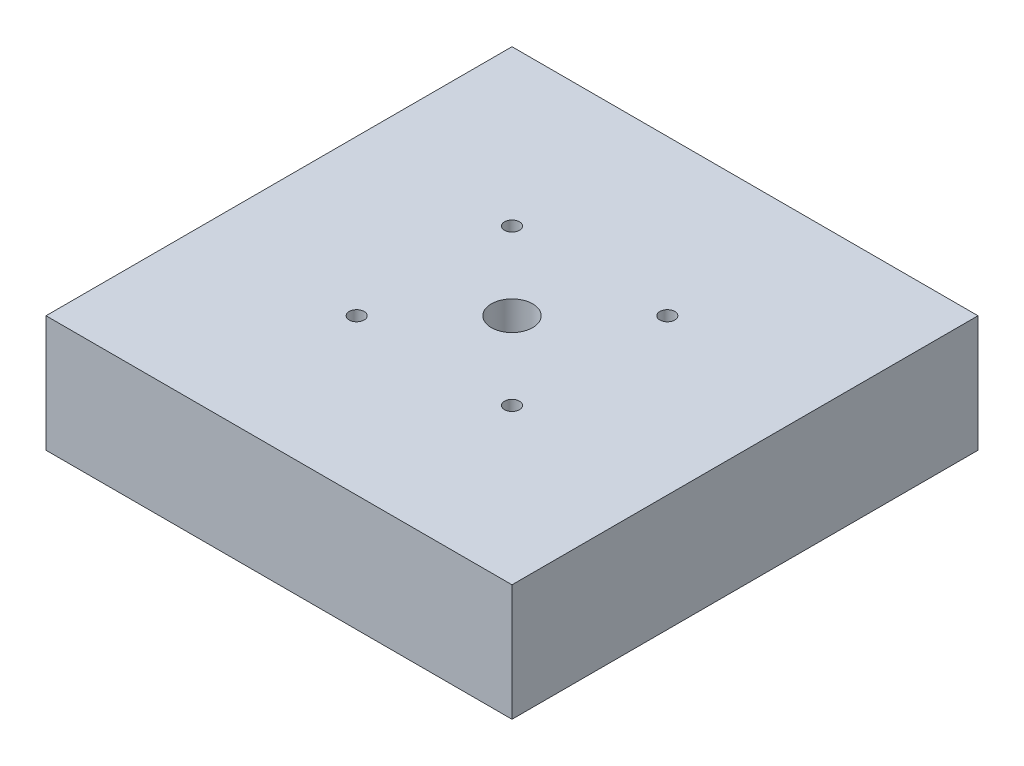
ISO-10303-21;
HEADER;
FILE_DESCRIPTION(('STEP AP214'),'2;1');
FILE_NAME('part.step','',(''),(''),'','','');
FILE_SCHEMA(('AUTOMOTIVE_DESIGN { 1 0 10303 214 1 1 1 1 }'));
ENDSEC;
DATA;
#1=APPLICATION_CONTEXT('core data for automotive mechanical design processes');
#2=APPLICATION_PROTOCOL_DEFINITION('international standard','automotive_design',2000,#1);
#3=PRODUCT_CONTEXT('',#1,'mechanical');
#4=PRODUCT('Part','Part','',(#3));
#5=PRODUCT_RELATED_PRODUCT_CATEGORY('part','',(#4));
#6=PRODUCT_DEFINITION_FORMATION('','',#4);
#7=PRODUCT_DEFINITION_CONTEXT('part definition',#1,'design');
#8=PRODUCT_DEFINITION('design','',#6,#7);
#9=PRODUCT_DEFINITION_SHAPE('','',#8);
#10=(LENGTH_UNIT() NAMED_UNIT(*) SI_UNIT(.MILLI.,.METRE.));
#11=(NAMED_UNIT(*) PLANE_ANGLE_UNIT() SI_UNIT($,.RADIAN.));
#12=(NAMED_UNIT(*) SI_UNIT($,.STERADIAN.) SOLID_ANGLE_UNIT());
#13=UNCERTAINTY_MEASURE_WITH_UNIT(LENGTH_MEASURE(1.E-05),#10,'distance_accuracy_value','');
#14=(GEOMETRIC_REPRESENTATION_CONTEXT(3) GLOBAL_UNCERTAINTY_ASSIGNED_CONTEXT((#13)) GLOBAL_UNIT_ASSIGNED_CONTEXT((#10,
#11,#12)) REPRESENTATION_CONTEXT('',''));
#15=CARTESIAN_POINT('',(0.,0.,0.));
#16=DIRECTION('',(0.,0.,1.));
#17=DIRECTION('',(1.,0.,0.));
#18=AXIS2_PLACEMENT_3D('',#15,#16,#17);
#19=CARTESIAN_POINT('',(-38.1,19.05,38.1));
#20=DIRECTION('',(1.,0.,0.));
#21=DIRECTION('',(0.,0.,-1.));
#22=AXIS2_PLACEMENT_3D('',#19,#20,#21);
#23=PLANE('',#22);
#24=DIRECTION('',(0.,0.,1.));
#25=VECTOR('',#24,1.);
#26=CARTESIAN_POINT('',(-38.1,0.,38.1));
#27=LINE('',#26,#25);
#28=CARTESIAN_POINT('',(-38.1,0.,-38.1));
#29=VERTEX_POINT('',#28);
#30=CARTESIAN_POINT('',(-38.1,0.,38.1));
#31=VERTEX_POINT('',#30);
#32=EDGE_CURVE('E96',#29,#31,#27,.T.);
#33=ORIENTED_EDGE('',*,*,#32,.T.);
#34=DIRECTION('',(0.,-1.,0.));
#35=VECTOR('',#34,1.);
#36=CARTESIAN_POINT('',(-38.1,19.05,38.1));
#37=LINE('',#36,#35);
#38=CARTESIAN_POINT('',(-38.1,19.05,38.1));
#39=VERTEX_POINT('',#38);
#40=EDGE_CURVE('E11',#39,#31,#37,.T.);
#41=ORIENTED_EDGE('',*,*,#40,.F.);
#42=DIRECTION('',(0.,0.,1.));
#43=VECTOR('',#42,1.);
#44=CARTESIAN_POINT('',(-38.1,19.05,38.1));
#45=LINE('',#44,#43);
#46=CARTESIAN_POINT('',(-38.1,19.05,-38.1));
#47=VERTEX_POINT('',#46);
#48=EDGE_CURVE('E84',#47,#39,#45,.T.);
#49=ORIENTED_EDGE('',*,*,#48,.F.);
#50=DIRECTION('',(0.,-1.,0.));
#51=VECTOR('',#50,1.);
#52=CARTESIAN_POINT('',(-38.1,19.05,-38.1));
#53=LINE('',#52,#51);
#54=EDGE_CURVE('E92',#47,#29,#53,.T.);
#55=ORIENTED_EDGE('',*,*,#54,.T.);
#56=EDGE_LOOP('',(#33,#41,#49,#55));
#57=FACE_BOUND('',#56,.T.);
#58=ADVANCED_FACE('F33',(#57),#23,.F.);
#59=CARTESIAN_POINT('',(38.1,19.05,38.1));
#60=DIRECTION('',(0.,0.,-1.));
#61=DIRECTION('',(-1.,0.,0.));
#62=AXIS2_PLACEMENT_3D('',#59,#60,#61);
#63=PLANE('',#62);
#64=DIRECTION('',(1.,0.,0.));
#65=VECTOR('',#64,1.);
#66=CARTESIAN_POINT('',(38.1,0.,38.1));
#67=LINE('',#66,#65);
#68=CARTESIAN_POINT('',(38.1,0.,38.1));
#69=VERTEX_POINT('',#68);
#70=EDGE_CURVE('E88',#31,#69,#67,.T.);
#71=ORIENTED_EDGE('',*,*,#70,.T.);
#72=DIRECTION('',(0.,-1.,0.));
#73=VECTOR('',#72,1.);
#74=CARTESIAN_POINT('',(38.1,19.05,38.1));
#75=LINE('',#74,#73);
#76=CARTESIAN_POINT('',(38.1,19.05,38.1));
#77=VERTEX_POINT('',#76);
#78=EDGE_CURVE('E41',#77,#69,#75,.T.);
#79=ORIENTED_EDGE('',*,*,#78,.F.);
#80=DIRECTION('',(1.,0.,0.));
#81=VECTOR('',#80,1.);
#82=CARTESIAN_POINT('',(38.1,19.05,38.1));
#83=LINE('',#82,#81);
#84=EDGE_CURVE('E79',#39,#77,#83,.T.);
#85=ORIENTED_EDGE('',*,*,#84,.F.);
#86=ORIENTED_EDGE('',*,*,#40,.T.);
#87=EDGE_LOOP('',(#71,#79,#85,#86));
#88=FACE_BOUND('',#87,.T.);
#89=ADVANCED_FACE('F87',(#88),#63,.F.);
#90=CARTESIAN_POINT('',(38.1,19.05,38.1));
#91=DIRECTION('',(-1.,0.,0.));
#92=DIRECTION('',(0.,0.,1.));
#93=AXIS2_PLACEMENT_3D('',#90,#91,#92);
#94=PLANE('',#93);
#95=DIRECTION('',(0.,0.,-1.));
#96=VECTOR('',#95,1.);
#97=CARTESIAN_POINT('',(38.1,0.,38.1));
#98=LINE('',#97,#96);
#99=CARTESIAN_POINT('',(38.1,0.,-38.1));
#100=VERTEX_POINT('',#99);
#101=EDGE_CURVE('E66',#69,#100,#98,.T.);
#102=ORIENTED_EDGE('',*,*,#101,.T.);
#103=DIRECTION('',(0.,-1.,0.));
#104=VECTOR('',#103,1.);
#105=CARTESIAN_POINT('',(38.1,19.05,-38.1));
#106=LINE('',#105,#104);
#107=CARTESIAN_POINT('',(38.1,19.05,-38.1));
#108=VERTEX_POINT('',#107);
#109=EDGE_CURVE('E89',#108,#100,#106,.T.);
#110=ORIENTED_EDGE('',*,*,#109,.F.);
#111=DIRECTION('',(0.,0.,-1.));
#112=VECTOR('',#111,1.);
#113=CARTESIAN_POINT('',(38.1,19.05,38.1));
#114=LINE('',#113,#112);
#115=EDGE_CURVE('E82',#77,#108,#114,.T.);
#116=ORIENTED_EDGE('',*,*,#115,.F.);
#117=ORIENTED_EDGE('',*,*,#78,.T.);
#118=EDGE_LOOP('',(#102,#110,#116,#117));
#119=FACE_BOUND('',#118,.T.);
#120=ADVANCED_FACE('F90',(#119),#94,.F.);
#121=CARTESIAN_POINT('',(38.1,19.05,-38.1));
#122=DIRECTION('',(0.,0.,1.));
#123=DIRECTION('',(1.,0.,0.));
#124=AXIS2_PLACEMENT_3D('',#121,#122,#123);
#125=PLANE('',#124);
#126=DIRECTION('',(-1.,0.,0.));
#127=VECTOR('',#126,1.);
#128=CARTESIAN_POINT('',(38.1,0.,-38.1));
#129=LINE('',#128,#127);
#130=EDGE_CURVE('E72',#100,#29,#129,.T.);
#131=ORIENTED_EDGE('',*,*,#130,.T.);
#132=ORIENTED_EDGE('',*,*,#54,.F.);
#133=DIRECTION('',(-1.,0.,0.));
#134=VECTOR('',#133,1.);
#135=CARTESIAN_POINT('',(38.1,19.05,-38.1));
#136=LINE('',#135,#134);
#137=EDGE_CURVE('E49',#108,#47,#136,.T.);
#138=ORIENTED_EDGE('',*,*,#137,.F.);
#139=ORIENTED_EDGE('',*,*,#109,.T.);
#140=EDGE_LOOP('',(#131,#132,#138,#139));
#141=FACE_BOUND('',#140,.T.);
#142=ADVANCED_FACE('F104',(#141),#125,.F.);
#143=CARTESIAN_POINT('',(0.,19.05,0.));
#144=DIRECTION('',(0.,1.,0.));
#145=DIRECTION('',(0.,0.,1.));
#146=AXIS2_PLACEMENT_3D('',#143,#144,#145);
#147=PLANE('',#146);
#148=CARTESIAN_POINT('',(12.7,19.05,-12.7));
#149=DIRECTION('',(0.,1.,0.));
#150=DIRECTION('',(0.,0.,1.));
#151=AXIS2_PLACEMENT_3D('',#148,#149,#150);
#152=CIRCLE('',#151,1.21919999999999);
#153=CARTESIAN_POINT('',(12.7,19.05,-11.4808));
#154=VERTEX_POINT('',#153);
#155=EDGE_CURVE('E136',#154,#154,#152,.T.);
#156=ORIENTED_EDGE('',*,*,#155,.F.);
#157=EDGE_LOOP('',(#156));
#158=FACE_BOUND('',#157,.T.);
#159=CARTESIAN_POINT('',(-12.7,19.05,12.7));
#160=DIRECTION('',(0.,1.,0.));
#161=DIRECTION('',(0.,0.,1.));
#162=AXIS2_PLACEMENT_3D('',#159,#160,#161);
#163=CIRCLE('',#162,1.21919999999999);
#164=CARTESIAN_POINT('',(-12.7,19.05,13.9192));
#165=VERTEX_POINT('',#164);
#166=EDGE_CURVE('E130',#165,#165,#163,.T.);
#167=ORIENTED_EDGE('',*,*,#166,.F.);
#168=EDGE_LOOP('',(#167));
#169=FACE_BOUND('',#168,.T.);
#170=CARTESIAN_POINT('',(12.7,19.05,12.7));
#171=DIRECTION('',(0.,1.,0.));
#172=DIRECTION('',(0.,0.,1.));
#173=AXIS2_PLACEMENT_3D('',#170,#171,#172);
#174=CIRCLE('',#173,1.21919999999999);
#175=CARTESIAN_POINT('',(12.7,19.05,13.9192));
#176=VERTEX_POINT('',#175);
#177=EDGE_CURVE('E124',#176,#176,#174,.T.);
#178=ORIENTED_EDGE('',*,*,#177,.F.);
#179=EDGE_LOOP('',(#178));
#180=FACE_BOUND('',#179,.T.);
#181=CARTESIAN_POINT('',(-12.7,19.05,-12.7));
#182=DIRECTION('',(0.,1.,0.));
#183=DIRECTION('',(0.,0.,1.));
#184=AXIS2_PLACEMENT_3D('',#181,#182,#183);
#185=CIRCLE('',#184,1.21919999999999);
#186=CARTESIAN_POINT('',(-12.7,19.05,-11.4808));
#187=VERTEX_POINT('',#186);
#188=EDGE_CURVE('E118',#187,#187,#185,.T.);
#189=ORIENTED_EDGE('',*,*,#188,.F.);
#190=EDGE_LOOP('',(#189));
#191=FACE_BOUND('',#190,.T.);
#192=CARTESIAN_POINT('',(0.,19.05,0.));
#193=DIRECTION('',(0.,1.,0.));
#194=DIRECTION('',(0.,0.,1.));
#195=AXIS2_PLACEMENT_3D('',#192,#193,#194);
#196=CIRCLE('',#195,3.37819999999999);
#197=CARTESIAN_POINT('',(0.,19.05,3.37819999999999));
#198=VERTEX_POINT('',#197);
#199=EDGE_CURVE('E112',#198,#198,#196,.T.);
#200=ORIENTED_EDGE('',*,*,#199,.F.);
#201=EDGE_LOOP('',(#200));
#202=FACE_BOUND('',#201,.T.);
#203=ORIENTED_EDGE('',*,*,#48,.T.);
#204=ORIENTED_EDGE('',*,*,#84,.T.);
#205=ORIENTED_EDGE('',*,*,#115,.T.);
#206=ORIENTED_EDGE('',*,*,#137,.T.);
#207=EDGE_LOOP('',(#203,#204,#205,#206));
#208=FACE_BOUND('',#207,.T.);
#209=ADVANCED_FACE('F80',(#158,#169,#180,#191,#202,#208),#147,.T.);
#210=CARTESIAN_POINT('',(0.,0.,0.));
#211=DIRECTION('',(0.,1.,0.));
#212=DIRECTION('',(0.,0.,1.));
#213=AXIS2_PLACEMENT_3D('',#210,#211,#212);
#214=PLANE('',#213);
#215=CARTESIAN_POINT('',(12.7,0.,-12.7));
#216=DIRECTION('',(0.,1.,0.));
#217=DIRECTION('',(0.,0.,1.));
#218=AXIS2_PLACEMENT_3D('',#215,#216,#217);
#219=CIRCLE('',#218,1.21919999999998);
#220=CARTESIAN_POINT('',(12.7,0.,-11.4808));
#221=VERTEX_POINT('',#220);
#222=EDGE_CURVE('E133',#221,#221,#219,.T.);
#223=ORIENTED_EDGE('',*,*,#222,.T.);
#224=EDGE_LOOP('',(#223));
#225=FACE_BOUND('',#224,.T.);
#226=CARTESIAN_POINT('',(-12.7,0.,12.7));
#227=DIRECTION('',(0.,1.,0.));
#228=DIRECTION('',(0.,0.,1.));
#229=AXIS2_PLACEMENT_3D('',#226,#227,#228);
#230=CIRCLE('',#229,1.21919999999998);
#231=CARTESIAN_POINT('',(-12.7,0.,13.9192));
#232=VERTEX_POINT('',#231);
#233=EDGE_CURVE('E127',#232,#232,#230,.T.);
#234=ORIENTED_EDGE('',*,*,#233,.T.);
#235=EDGE_LOOP('',(#234));
#236=FACE_BOUND('',#235,.T.);
#237=CARTESIAN_POINT('',(12.7,0.,12.7));
#238=DIRECTION('',(0.,1.,0.));
#239=DIRECTION('',(0.,0.,1.));
#240=AXIS2_PLACEMENT_3D('',#237,#238,#239);
#241=CIRCLE('',#240,1.21919999999998);
#242=CARTESIAN_POINT('',(12.7,0.,13.9192));
#243=VERTEX_POINT('',#242);
#244=EDGE_CURVE('E121',#243,#243,#241,.T.);
#245=ORIENTED_EDGE('',*,*,#244,.T.);
#246=EDGE_LOOP('',(#245));
#247=FACE_BOUND('',#246,.T.);
#248=CARTESIAN_POINT('',(-12.7,0.,-12.7));
#249=DIRECTION('',(0.,1.,0.));
#250=DIRECTION('',(0.,0.,1.));
#251=AXIS2_PLACEMENT_3D('',#248,#249,#250);
#252=CIRCLE('',#251,1.21919999999998);
#253=CARTESIAN_POINT('',(-12.7,0.,-11.4808));
#254=VERTEX_POINT('',#253);
#255=EDGE_CURVE('E115',#254,#254,#252,.T.);
#256=ORIENTED_EDGE('',*,*,#255,.T.);
#257=EDGE_LOOP('',(#256));
#258=FACE_BOUND('',#257,.T.);
#259=CARTESIAN_POINT('',(0.,0.,0.));
#260=DIRECTION('',(0.,1.,0.));
#261=DIRECTION('',(0.,0.,1.));
#262=AXIS2_PLACEMENT_3D('',#259,#260,#261);
#263=CIRCLE('',#262,3.37819999999999);
#264=CARTESIAN_POINT('',(0.,0.,3.37819999999999));
#265=VERTEX_POINT('',#264);
#266=EDGE_CURVE('E99',#265,#265,#263,.T.);
#267=ORIENTED_EDGE('',*,*,#266,.T.);
#268=EDGE_LOOP('',(#267));
#269=FACE_BOUND('',#268,.T.);
#270=ORIENTED_EDGE('',*,*,#32,.F.);
#271=ORIENTED_EDGE('',*,*,#130,.F.);
#272=ORIENTED_EDGE('',*,*,#101,.F.);
#273=ORIENTED_EDGE('',*,*,#70,.F.);
#274=EDGE_LOOP('',(#270,#271,#272,#273));
#275=FACE_BOUND('',#274,.T.);
#276=ADVANCED_FACE('F107',(#225,#236,#247,#258,#269,#275),#214,.F.);
#277=CARTESIAN_POINT('',(0.,19.05,0.));
#278=DIRECTION('',(0.,1.,0.));
#279=DIRECTION('',(0.,0.,1.));
#280=AXIS2_PLACEMENT_3D('',#277,#278,#279);
#281=CYLINDRICAL_SURFACE('',#280,3.37819999999999);
#282=ORIENTED_EDGE('',*,*,#266,.F.);
#283=EDGE_LOOP('',(#282));
#284=FACE_BOUND('',#283,.T.);
#285=ORIENTED_EDGE('',*,*,#199,.T.);
#286=EDGE_LOOP('',(#285));
#287=FACE_BOUND('',#286,.T.);
#288=ADVANCED_FACE('F153',(#284,#287),#281,.F.);
#289=CARTESIAN_POINT('',(-12.7,19.05,-12.7));
#290=DIRECTION('',(0.,1.,0.));
#291=DIRECTION('',(0.,0.,1.));
#292=AXIS2_PLACEMENT_3D('',#289,#290,#291);
#293=CYLINDRICAL_SURFACE('',#292,1.21919999999999);
#294=ORIENTED_EDGE('',*,*,#255,.F.);
#295=EDGE_LOOP('',(#294));
#296=FACE_BOUND('',#295,.T.);
#297=ORIENTED_EDGE('',*,*,#188,.T.);
#298=EDGE_LOOP('',(#297));
#299=FACE_BOUND('',#298,.T.);
#300=ADVANCED_FACE('F155',(#296,#299),#293,.F.);
#301=CARTESIAN_POINT('',(12.7,19.05,12.7));
#302=DIRECTION('',(0.,1.,0.));
#303=DIRECTION('',(0.,0.,1.));
#304=AXIS2_PLACEMENT_3D('',#301,#302,#303);
#305=CYLINDRICAL_SURFACE('',#304,1.21919999999999);
#306=ORIENTED_EDGE('',*,*,#244,.F.);
#307=EDGE_LOOP('',(#306));
#308=FACE_BOUND('',#307,.T.);
#309=ORIENTED_EDGE('',*,*,#177,.T.);
#310=EDGE_LOOP('',(#309));
#311=FACE_BOUND('',#310,.T.);
#312=ADVANCED_FACE('F162',(#308,#311),#305,.F.);
#313=CARTESIAN_POINT('',(-12.7,19.05,12.7));
#314=DIRECTION('',(0.,1.,0.));
#315=DIRECTION('',(0.,0.,1.));
#316=AXIS2_PLACEMENT_3D('',#313,#314,#315);
#317=CYLINDRICAL_SURFACE('',#316,1.21919999999999);
#318=ORIENTED_EDGE('',*,*,#233,.F.);
#319=EDGE_LOOP('',(#318));
#320=FACE_BOUND('',#319,.T.);
#321=ORIENTED_EDGE('',*,*,#166,.T.);
#322=EDGE_LOOP('',(#321));
#323=FACE_BOUND('',#322,.T.);
#324=ADVANCED_FACE('F201',(#320,#323),#317,.F.);
#325=CARTESIAN_POINT('',(12.7,19.05,-12.7));
#326=DIRECTION('',(0.,1.,0.));
#327=DIRECTION('',(0.,0.,1.));
#328=AXIS2_PLACEMENT_3D('',#325,#326,#327);
#329=CYLINDRICAL_SURFACE('',#328,1.21919999999999);
#330=ORIENTED_EDGE('',*,*,#222,.F.);
#331=EDGE_LOOP('',(#330));
#332=FACE_BOUND('',#331,.T.);
#333=ORIENTED_EDGE('',*,*,#155,.T.);
#334=EDGE_LOOP('',(#333));
#335=FACE_BOUND('',#334,.T.);
#336=ADVANCED_FACE('F140',(#332,#335),#329,.F.);
#337=CLOSED_SHELL('',(#58,#89,#120,#142,#209,#276,#288,#300,#312,#324,#336));
#338=MANIFOLD_SOLID_BREP('B2',#337);
#339=ADVANCED_BREP_SHAPE_REPRESENTATION('',(#18,#338),#14);
#340=SHAPE_DEFINITION_REPRESENTATION(#9,#339);
ENDSEC;
END-ISO-10303-21;
